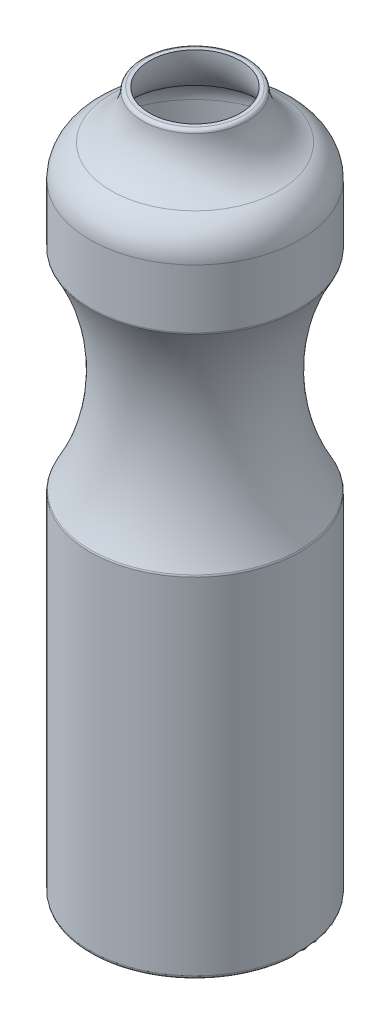
ISO-10303-21;
HEADER;
FILE_DESCRIPTION(('STEP AP214'),'2;1');
FILE_NAME('part.step','',(''),(''),'','','');
FILE_SCHEMA(('AUTOMOTIVE_DESIGN { 1 0 10303 214 1 1 1 1 }'));
ENDSEC;
DATA;
#1=APPLICATION_CONTEXT('core data for automotive mechanical design processes');
#2=APPLICATION_PROTOCOL_DEFINITION('international standard','automotive_design',2000,#1);
#3=PRODUCT_CONTEXT('',#1,'mechanical');
#4=PRODUCT('Part','Part','',(#3));
#5=PRODUCT_RELATED_PRODUCT_CATEGORY('part','',(#4));
#6=PRODUCT_DEFINITION_FORMATION('','',#4);
#7=PRODUCT_DEFINITION_CONTEXT('part definition',#1,'design');
#8=PRODUCT_DEFINITION('design','',#6,#7);
#9=PRODUCT_DEFINITION_SHAPE('','',#8);
#10=(LENGTH_UNIT() NAMED_UNIT(*) SI_UNIT(.MILLI.,.METRE.));
#11=(NAMED_UNIT(*) PLANE_ANGLE_UNIT() SI_UNIT($,.RADIAN.));
#12=(NAMED_UNIT(*) SI_UNIT($,.STERADIAN.) SOLID_ANGLE_UNIT());
#13=UNCERTAINTY_MEASURE_WITH_UNIT(LENGTH_MEASURE(1.E-05),#10,'distance_accuracy_value','');
#14=(GEOMETRIC_REPRESENTATION_CONTEXT(3) GLOBAL_UNCERTAINTY_ASSIGNED_CONTEXT((#13)) GLOBAL_UNIT_ASSIGNED_CONTEXT((#10,
#11,#12)) REPRESENTATION_CONTEXT('',''));
#15=CARTESIAN_POINT('',(0.,0.,0.));
#16=DIRECTION('',(0.,0.,1.));
#17=DIRECTION('',(1.,0.,0.));
#18=AXIS2_PLACEMENT_3D('',#15,#16,#17);
#19=CARTESIAN_POINT('',(0.,130.,0.));
#20=DIRECTION('',(0.,-1.,0.));
#21=DIRECTION('',(0.,0.,-1.));
#22=AXIS2_PLACEMENT_3D('',#19,#20,#21);
#23=TOROIDAL_SURFACE('',#22,81.9615242270663,60.);
#24=CARTESIAN_POINT('',(0.,159.770586704393,0.));
#25=DIRECTION('',(0.,-1.,0.));
#26=DIRECTION('',(0.,0.,-1.));
#27=AXIS2_PLACEMENT_3D('',#24,#25,#26);
#28=CIRCLE('',#27,29.8682217086404);
#29=CARTESIAN_POINT('',(0.,159.770586704393,-29.8682217086404));
#30=VERTEX_POINT('',#29);
#31=EDGE_CURVE('E10',#30,#30,#28,.T.);
#32=ORIENTED_EDGE('',*,*,#31,.T.);
#33=EDGE_LOOP('',(#32));
#34=FACE_BOUND('',#33,.T.);
#35=CARTESIAN_POINT('',(0.,100.229413295607,0.));
#36=DIRECTION('',(0.,-1.,0.));
#37=DIRECTION('',(0.,0.,-1.));
#38=AXIS2_PLACEMENT_3D('',#35,#36,#37);
#39=CIRCLE('',#38,29.8682217086405);
#40=CARTESIAN_POINT('',(0.,100.229413295607,-29.8682217086405));
#41=VERTEX_POINT('',#40);
#42=EDGE_CURVE('E67',#41,#41,#39,.T.);
#43=ORIENTED_EDGE('',*,*,#42,.F.);
#44=EDGE_LOOP('',(#43));
#45=FACE_BOUND('',#44,.T.);
#46=ADVANCED_FACE('F33',(#34,#45),#23,.F.);
#47=CARTESIAN_POINT('',(0.,160.266763149466,0.));
#48=DIRECTION('',(0.,-1.,0.));
#49=DIRECTION('',(0.,0.,-1.));
#50=AXIS2_PLACEMENT_3D('',#47,#48,#49);
#51=TOROIDAL_SURFACE('',#50,29.,1.);
#52=CARTESIAN_POINT('',(0.,160.266763149466,0.));
#53=DIRECTION('',(0.,-1.,0.));
#54=DIRECTION('',(0.,0.,-1.));
#55=AXIS2_PLACEMENT_3D('',#52,#53,#54);
#56=CIRCLE('',#55,30.);
#57=CARTESIAN_POINT('',(0.,160.266763149466,-30.));
#58=VERTEX_POINT('',#57);
#59=EDGE_CURVE('E39',#58,#58,#56,.T.);
#60=ORIENTED_EDGE('',*,*,#59,.T.);
#61=EDGE_LOOP('',(#60));
#62=FACE_BOUND('',#61,.T.);
#63=ORIENTED_EDGE('',*,*,#31,.F.);
#64=EDGE_LOOP('',(#63));
#65=FACE_BOUND('',#64,.T.);
#66=ADVANCED_FACE('F115',(#62,#65),#51,.T.);
#67=CARTESIAN_POINT('',(0.,0.,0.));
#68=DIRECTION('',(0.,-1.,0.));
#69=DIRECTION('',(0.,0.,-1.));
#70=AXIS2_PLACEMENT_3D('',#67,#68,#69);
#71=CYLINDRICAL_SURFACE('',#70,30.);
#72=CARTESIAN_POINT('',(0.,177.087121525221,0.));
#73=DIRECTION('',(0.,-1.,0.));
#74=DIRECTION('',(0.,0.,-1.));
#75=AXIS2_PLACEMENT_3D('',#72,#73,#74);
#76=CIRCLE('',#75,30.);
#77=CARTESIAN_POINT('',(0.,177.087121525221,-30.));
#78=VERTEX_POINT('',#77);
#79=EDGE_CURVE('E43',#78,#78,#76,.T.);
#80=ORIENTED_EDGE('',*,*,#79,.T.);
#81=EDGE_LOOP('',(#80));
#82=FACE_BOUND('',#81,.T.);
#83=ORIENTED_EDGE('',*,*,#59,.F.);
#84=EDGE_LOOP('',(#83));
#85=FACE_BOUND('',#84,.T.);
#86=ADVANCED_FACE('F119',(#82,#85),#71,.T.);
#87=CARTESIAN_POINT('',(0.,177.087121525221,0.));
#88=DIRECTION('',(0.,-1.,0.));
#89=DIRECTION('',(0.,0.,-1.));
#90=AXIS2_PLACEMENT_3D('',#87,#88,#89);
#91=TOROIDAL_SURFACE('',#90,20.,9.99999999999999);
#92=CARTESIAN_POINT('',(0.,186.252272915132,0.));
#93=DIRECTION('',(0.,-1.,0.));
#94=DIRECTION('',(0.,0.,-1.));
#95=AXIS2_PLACEMENT_3D('',#92,#93,#94);
#96=CIRCLE('',#95,24.);
#97=CARTESIAN_POINT('',(0.,186.252272915132,-24.));
#98=VERTEX_POINT('',#97);
#99=EDGE_CURVE('E47',#98,#98,#96,.T.);
#100=ORIENTED_EDGE('',*,*,#99,.T.);
#101=EDGE_LOOP('',(#100));
#102=FACE_BOUND('',#101,.T.);
#103=ORIENTED_EDGE('',*,*,#79,.F.);
#104=EDGE_LOOP('',(#103));
#105=FACE_BOUND('',#104,.T.);
#106=ADVANCED_FACE('F157',(#102,#105),#91,.T.);
#107=CARTESIAN_POINT('',(0.,200.,0.));
#108=DIRECTION('',(0.,-1.,0.));
#109=DIRECTION('',(0.,0.,-1.));
#110=AXIS2_PLACEMENT_3D('',#107,#108,#109);
#111=TOROIDAL_SURFACE('',#110,30.,15.);
#112=CARTESIAN_POINT('',(0.,199.0625,0.));
#113=DIRECTION('',(0.,-1.,0.));
#114=DIRECTION('',(0.,0.,-1.));
#115=AXIS2_PLACEMENT_3D('',#112,#113,#114);
#116=CIRCLE('',#115,15.0293255412456);
#117=CARTESIAN_POINT('',(0.,199.0625,-15.0293255412456));
#118=VERTEX_POINT('',#117);
#119=EDGE_CURVE('E52',#118,#118,#116,.T.);
#120=ORIENTED_EDGE('',*,*,#119,.T.);
#121=EDGE_LOOP('',(#120));
#122=FACE_BOUND('',#121,.T.);
#123=ORIENTED_EDGE('',*,*,#99,.F.);
#124=EDGE_LOOP('',(#123));
#125=FACE_BOUND('',#124,.T.);
#126=ADVANCED_FACE('F153',(#122,#125),#111,.F.);
#127=CARTESIAN_POINT('',(0.,199.,0.));
#128=DIRECTION('',(0.,-1.,0.));
#129=DIRECTION('',(0.,0.,-1.));
#130=AXIS2_PLACEMENT_3D('',#127,#128,#129);
#131=TOROIDAL_SURFACE('',#130,14.0312805773287,1.);
#132=CARTESIAN_POINT('',(0.,200.,0.));
#133=DIRECTION('',(0.,-1.,0.));
#134=DIRECTION('',(0.,0.,-1.));
#135=AXIS2_PLACEMENT_3D('',#132,#133,#134);
#136=CIRCLE('',#135,14.0312805773287);
#137=CARTESIAN_POINT('',(0.,200.,-14.0312805773287));
#138=VERTEX_POINT('',#137);
#139=EDGE_CURVE('E55',#138,#138,#136,.T.);
#140=ORIENTED_EDGE('',*,*,#139,.T.);
#141=EDGE_LOOP('',(#140));
#142=FACE_BOUND('',#141,.T.);
#143=ORIENTED_EDGE('',*,*,#119,.F.);
#144=EDGE_LOOP('',(#143));
#145=FACE_BOUND('',#144,.T.);
#146=ADVANCED_FACE('F147',(#142,#145),#131,.T.);
#147=CARTESIAN_POINT('',(0.,200.,0.));
#148=DIRECTION('',(0.,1.,0.));
#149=DIRECTION('',(0.,0.,1.));
#150=AXIS2_PLACEMENT_3D('',#147,#148,#149);
#151=PLANE('',#150);
#152=CARTESIAN_POINT('',(0.,200.,0.));
#153=DIRECTION('',(0.,-1.,0.));
#154=DIRECTION('',(0.,0.,-1.));
#155=AXIS2_PLACEMENT_3D('',#152,#153,#154);
#156=CIRCLE('',#155,13.);
#157=CARTESIAN_POINT('',(0.,200.,-13.));
#158=VERTEX_POINT('',#157);
#159=EDGE_CURVE('E71',#158,#158,#156,.T.);
#160=ORIENTED_EDGE('',*,*,#159,.T.);
#161=EDGE_LOOP('',(#160));
#162=FACE_BOUND('',#161,.T.);
#163=ORIENTED_EDGE('',*,*,#139,.F.);
#164=EDGE_LOOP('',(#163));
#165=FACE_BOUND('',#164,.T.);
#166=ADVANCED_FACE('F142',(#162,#165),#151,.T.);
#167=CARTESIAN_POINT('',(0.,0.,0.));
#168=DIRECTION('',(0.,-1.,0.));
#169=DIRECTION('',(0.,0.,-1.));
#170=AXIS2_PLACEMENT_3D('',#167,#168,#169);
#171=PLANE('',#170);
#172=CARTESIAN_POINT('',(0.,0.,0.));
#173=DIRECTION('',(0.,-1.,0.));
#174=DIRECTION('',(0.,0.,-1.));
#175=AXIS2_PLACEMENT_3D('',#172,#173,#174);
#176=CIRCLE('',#175,29.);
#177=CARTESIAN_POINT('',(0.,0.,-29.));
#178=VERTEX_POINT('',#177);
#179=EDGE_CURVE('E58',#178,#178,#176,.T.);
#180=ORIENTED_EDGE('',*,*,#179,.T.);
#181=EDGE_LOOP('',(#180));
#182=FACE_BOUND('',#181,.T.);
#183=ADVANCED_FACE('F137',(#182),#171,.T.);
#184=CARTESIAN_POINT('',(0.,1.,0.));
#185=DIRECTION('',(0.,-1.,0.));
#186=DIRECTION('',(0.,0.,-1.));
#187=AXIS2_PLACEMENT_3D('',#184,#185,#186);
#188=TOROIDAL_SURFACE('',#187,29.,0.999999999999999);
#189=CARTESIAN_POINT('',(0.,1.,0.));
#190=DIRECTION('',(0.,-1.,0.));
#191=DIRECTION('',(0.,0.,-1.));
#192=AXIS2_PLACEMENT_3D('',#189,#190,#191);
#193=CIRCLE('',#192,30.);
#194=CARTESIAN_POINT('',(0.,1.,-30.));
#195=VERTEX_POINT('',#194);
#196=EDGE_CURVE('E61',#195,#195,#193,.T.);
#197=ORIENTED_EDGE('',*,*,#196,.T.);
#198=EDGE_LOOP('',(#197));
#199=FACE_BOUND('',#198,.T.);
#200=ORIENTED_EDGE('',*,*,#179,.F.);
#201=EDGE_LOOP('',(#200));
#202=FACE_BOUND('',#201,.T.);
#203=ADVANCED_FACE('F131',(#199,#202),#188,.T.);
#204=CARTESIAN_POINT('',(0.,0.,0.));
#205=DIRECTION('',(0.,-1.,0.));
#206=DIRECTION('',(0.,0.,-1.));
#207=AXIS2_PLACEMENT_3D('',#204,#205,#206);
#208=CYLINDRICAL_SURFACE('',#207,30.);
#209=CARTESIAN_POINT('',(0.,99.7332368505341,0.));
#210=DIRECTION('',(0.,-1.,0.));
#211=DIRECTION('',(0.,0.,-1.));
#212=AXIS2_PLACEMENT_3D('',#209,#210,#211);
#213=CIRCLE('',#212,30.);
#214=CARTESIAN_POINT('',(0.,99.7332368505341,-30.));
#215=VERTEX_POINT('',#214);
#216=EDGE_CURVE('E64',#215,#215,#213,.T.);
#217=ORIENTED_EDGE('',*,*,#216,.T.);
#218=EDGE_LOOP('',(#217));
#219=FACE_BOUND('',#218,.T.);
#220=ORIENTED_EDGE('',*,*,#196,.F.);
#221=EDGE_LOOP('',(#220));
#222=FACE_BOUND('',#221,.T.);
#223=ADVANCED_FACE('F125',(#219,#222),#208,.T.);
#224=CARTESIAN_POINT('',(0.,99.7332368505341,0.));
#225=DIRECTION('',(0.,-1.,0.));
#226=DIRECTION('',(0.,0.,-1.));
#227=AXIS2_PLACEMENT_3D('',#224,#225,#226);
#228=TOROIDAL_SURFACE('',#227,29.,1.);
#229=ORIENTED_EDGE('',*,*,#42,.T.);
#230=EDGE_LOOP('',(#229));
#231=FACE_BOUND('',#230,.T.);
#232=ORIENTED_EDGE('',*,*,#216,.F.);
#233=EDGE_LOOP('',(#232));
#234=FACE_BOUND('',#233,.T.);
#235=ADVANCED_FACE('F94',(#231,#234),#228,.T.);
#236=CARTESIAN_POINT('',(0.,130.,0.));
#237=DIRECTION('',(0.,-1.,0.));
#238=DIRECTION('',(0.,0.,-1.));
#239=AXIS2_PLACEMENT_3D('',#236,#237,#238);
#240=TOROIDAL_SURFACE('',#239,81.9615242270663,62.);
#241=CARTESIAN_POINT('',(0.,160.53119557259,0.));
#242=DIRECTION('',(0.,-1.,0.));
#243=DIRECTION('',(0.,0.,-1.));
#244=AXIS2_PLACEMENT_3D('',#241,#242,#243);
#245=CIRCLE('',#244,28.);
#246=CARTESIAN_POINT('',(0.,160.53119557259,-28.));
#247=VERTEX_POINT('',#246);
#248=EDGE_CURVE('E70',#247,#247,#245,.T.);
#249=ORIENTED_EDGE('',*,*,#248,.F.);
#250=EDGE_LOOP('',(#249));
#251=FACE_BOUND('',#250,.T.);
#252=CARTESIAN_POINT('',(0.,99.4688044274101,0.));
#253=DIRECTION('',(0.,1.,0.));
#254=DIRECTION('',(0.,0.,1.));
#255=AXIS2_PLACEMENT_3D('',#252,#253,#254);
#256=CIRCLE('',#255,28.);
#257=CARTESIAN_POINT('',(0.,99.4688044274101,28.));
#258=VERTEX_POINT('',#257);
#259=EDGE_CURVE('E78',#258,#258,#256,.F.);
#260=ORIENTED_EDGE('',*,*,#259,.T.);
#261=EDGE_LOOP('',(#260));
#262=FACE_BOUND('',#261,.T.);
#263=ADVANCED_FACE('F91',(#251,#262),#240,.T.);
#264=CARTESIAN_POINT('',(0.,0.,0.));
#265=DIRECTION('',(0.,-1.,0.));
#266=DIRECTION('',(0.,0.,-1.));
#267=AXIS2_PLACEMENT_3D('',#264,#265,#266);
#268=CYLINDRICAL_SURFACE('',#267,28.);
#269=CARTESIAN_POINT('',(0.,177.087121525221,0.));
#270=DIRECTION('',(0.,-1.,0.));
#271=DIRECTION('',(0.,0.,-1.));
#272=AXIS2_PLACEMENT_3D('',#269,#270,#271);
#273=CIRCLE('',#272,28.);
#274=CARTESIAN_POINT('',(0.,177.087121525221,-28.));
#275=VERTEX_POINT('',#274);
#276=EDGE_CURVE('E81',#275,#275,#273,.T.);
#277=ORIENTED_EDGE('',*,*,#276,.F.);
#278=EDGE_LOOP('',(#277));
#279=FACE_BOUND('',#278,.T.);
#280=ORIENTED_EDGE('',*,*,#248,.T.);
#281=EDGE_LOOP('',(#280));
#282=FACE_BOUND('',#281,.T.);
#283=ADVANCED_FACE('F89',(#279,#282),#268,.F.);
#284=CARTESIAN_POINT('',(0.,177.087121525221,0.));
#285=DIRECTION('',(0.,-1.,0.));
#286=DIRECTION('',(0.,0.,-1.));
#287=AXIS2_PLACEMENT_3D('',#284,#285,#286);
#288=TOROIDAL_SURFACE('',#287,20.,7.99999999999999);
#289=CARTESIAN_POINT('',(0.,184.41924263715,0.));
#290=DIRECTION('',(0.,-1.,0.));
#291=DIRECTION('',(0.,0.,-1.));
#292=AXIS2_PLACEMENT_3D('',#289,#290,#291);
#293=CIRCLE('',#292,23.2);
#294=CARTESIAN_POINT('',(0.,184.41924263715,-23.2));
#295=VERTEX_POINT('',#294);
#296=EDGE_CURVE('E74',#295,#295,#293,.T.);
#297=ORIENTED_EDGE('',*,*,#296,.F.);
#298=EDGE_LOOP('',(#297));
#299=FACE_BOUND('',#298,.T.);
#300=ORIENTED_EDGE('',*,*,#276,.T.);
#301=EDGE_LOOP('',(#300));
#302=FACE_BOUND('',#301,.T.);
#303=ADVANCED_FACE('F111',(#299,#302),#288,.F.);
#304=CARTESIAN_POINT('',(0.,200.,0.));
#305=DIRECTION('',(0.,-1.,0.));
#306=DIRECTION('',(0.,0.,-1.));
#307=AXIS2_PLACEMENT_3D('',#304,#305,#306);
#308=TOROIDAL_SURFACE('',#307,30.,17.);
#309=ORIENTED_EDGE('',*,*,#159,.F.);
#310=EDGE_LOOP('',(#309));
#311=FACE_BOUND('',#310,.T.);
#312=ORIENTED_EDGE('',*,*,#296,.T.);
#313=EDGE_LOOP('',(#312));
#314=FACE_BOUND('',#313,.T.);
#315=ADVANCED_FACE('F106',(#311,#314),#308,.T.);
#316=CARTESIAN_POINT('',(0.,2.,0.));
#317=DIRECTION('',(0.,-1.,0.));
#318=DIRECTION('',(0.,0.,-1.));
#319=AXIS2_PLACEMENT_3D('',#316,#317,#318);
#320=PLANE('',#319);
#321=CARTESIAN_POINT('',(0.,2.,0.));
#322=DIRECTION('',(0.,-1.,0.));
#323=DIRECTION('',(0.,0.,-1.));
#324=AXIS2_PLACEMENT_3D('',#321,#322,#323);
#325=CIRCLE('',#324,28.);
#326=CARTESIAN_POINT('',(0.,2.,-28.));
#327=VERTEX_POINT('',#326);
#328=EDGE_CURVE('E75',#327,#327,#325,.T.);
#329=ORIENTED_EDGE('',*,*,#328,.F.);
#330=EDGE_LOOP('',(#329));
#331=FACE_BOUND('',#330,.T.);
#332=ADVANCED_FACE('F101',(#331),#320,.F.);
#333=CARTESIAN_POINT('',(0.,0.,0.));
#334=DIRECTION('',(0.,-1.,0.));
#335=DIRECTION('',(0.,0.,-1.));
#336=AXIS2_PLACEMENT_3D('',#333,#334,#335);
#337=CYLINDRICAL_SURFACE('',#336,28.);
#338=ORIENTED_EDGE('',*,*,#259,.F.);
#339=EDGE_LOOP('',(#338));
#340=FACE_BOUND('',#339,.T.);
#341=ORIENTED_EDGE('',*,*,#328,.T.);
#342=EDGE_LOOP('',(#341));
#343=FACE_BOUND('',#342,.T.);
#344=ADVANCED_FACE('F98',(#340,#343),#337,.F.);
#345=CLOSED_SHELL('',(#46,#66,#86,#106,#126,#146,#166,#183,#203,#223,#235,#263,#283,#303,#315,
#332,#344));
#346=MANIFOLD_SOLID_BREP('B2',#345);
#347=ADVANCED_BREP_SHAPE_REPRESENTATION('',(#18,#346),#14);
#348=SHAPE_DEFINITION_REPRESENTATION(#9,#347);
ENDSEC;
END-ISO-10303-21;
